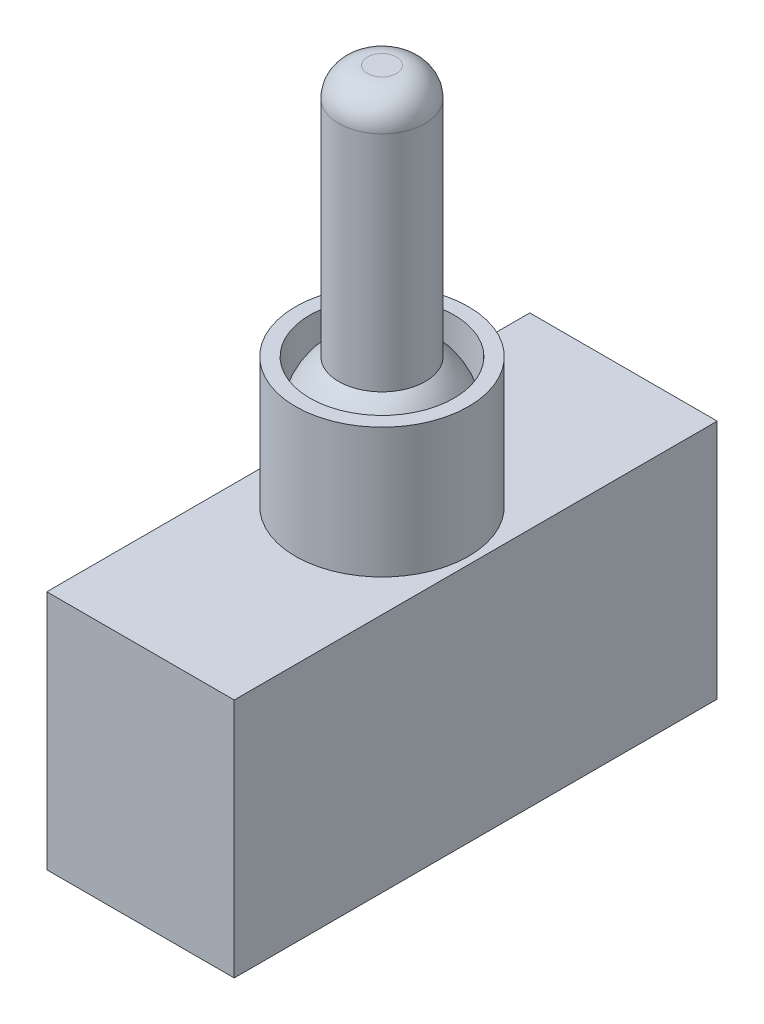
ISO-10303-21;
HEADER;
FILE_DESCRIPTION(('STEP AP214'),'2;1');
FILE_NAME('part.step','',(''),(''),'','','');
FILE_SCHEMA(('AUTOMOTIVE_DESIGN { 1 0 10303 214 1 1 1 1 }'));
ENDSEC;
DATA;
#1=APPLICATION_CONTEXT('core data for automotive mechanical design processes');
#2=APPLICATION_PROTOCOL_DEFINITION('international standard','automotive_design',2000,#1);
#3=PRODUCT_CONTEXT('',#1,'mechanical');
#4=PRODUCT('Part','Part','',(#3));
#5=PRODUCT_RELATED_PRODUCT_CATEGORY('part','',(#4));
#6=PRODUCT_DEFINITION_FORMATION('','',#4);
#7=PRODUCT_DEFINITION_CONTEXT('part definition',#1,'design');
#8=PRODUCT_DEFINITION('design','',#6,#7);
#9=PRODUCT_DEFINITION_SHAPE('','',#8);
#10=(LENGTH_UNIT() NAMED_UNIT(*) SI_UNIT(.MILLI.,.METRE.));
#11=(NAMED_UNIT(*) PLANE_ANGLE_UNIT() SI_UNIT($,.RADIAN.));
#12=(NAMED_UNIT(*) SI_UNIT($,.STERADIAN.) SOLID_ANGLE_UNIT());
#13=UNCERTAINTY_MEASURE_WITH_UNIT(LENGTH_MEASURE(1.E-05),#10,'distance_accuracy_value','');
#14=(GEOMETRIC_REPRESENTATION_CONTEXT(3) GLOBAL_UNCERTAINTY_ASSIGNED_CONTEXT((#13)) GLOBAL_UNIT_ASSIGNED_CONTEXT((#10,
#11,#12)) REPRESENTATION_CONTEXT('',''));
#15=CARTESIAN_POINT('',(0.,0.,0.));
#16=DIRECTION('',(0.,0.,1.));
#17=DIRECTION('',(1.,0.,0.));
#18=AXIS2_PLACEMENT_3D('',#15,#16,#17);
#19=CARTESIAN_POINT('',(-6.5,16.7,16.75));
#20=DIRECTION('',(1.,0.,0.));
#21=DIRECTION('',(0.,0.,-1.));
#22=AXIS2_PLACEMENT_3D('',#19,#20,#21);
#23=PLANE('',#22);
#24=DIRECTION('',(0.,0.,1.));
#25=VECTOR('',#24,1.);
#26=CARTESIAN_POINT('',(-6.5,0.,16.75));
#27=LINE('',#26,#25);
#28=CARTESIAN_POINT('',(-6.5,0.,-16.75));
#29=VERTEX_POINT('',#28);
#30=CARTESIAN_POINT('',(-6.5,0.,16.75));
#31=VERTEX_POINT('',#30);
#32=EDGE_CURVE('E103',#29,#31,#27,.T.);
#33=ORIENTED_EDGE('',*,*,#32,.T.);
#34=DIRECTION('',(0.,-1.,0.));
#35=VECTOR('',#34,1.);
#36=CARTESIAN_POINT('',(-6.5,16.7,16.75));
#37=LINE('',#36,#35);
#38=CARTESIAN_POINT('',(-6.5,16.7,16.75));
#39=VERTEX_POINT('',#38);
#40=EDGE_CURVE('E94',#39,#31,#37,.T.);
#41=ORIENTED_EDGE('',*,*,#40,.F.);
#42=DIRECTION('',(0.,0.,1.));
#43=VECTOR('',#42,1.);
#44=CARTESIAN_POINT('',(-6.5,16.7,16.75));
#45=LINE('',#44,#43);
#46=CARTESIAN_POINT('',(-6.5,16.7,-16.75));
#47=VERTEX_POINT('',#46);
#48=EDGE_CURVE('E88',#47,#39,#45,.T.);
#49=ORIENTED_EDGE('',*,*,#48,.F.);
#50=DIRECTION('',(0.,-1.,0.));
#51=VECTOR('',#50,1.);
#52=CARTESIAN_POINT('',(-6.5,16.7,-16.75));
#53=LINE('',#52,#51);
#54=EDGE_CURVE('E99',#47,#29,#53,.T.);
#55=ORIENTED_EDGE('',*,*,#54,.T.);
#56=EDGE_LOOP('',(#33,#41,#49,#55));
#57=FACE_BOUND('',#56,.T.);
#58=ADVANCED_FACE('F35',(#57),#23,.F.);
#59=CARTESIAN_POINT('',(6.5,16.7,16.75));
#60=DIRECTION('',(0.,0.,-1.));
#61=DIRECTION('',(-1.,0.,0.));
#62=AXIS2_PLACEMENT_3D('',#59,#60,#61);
#63=PLANE('',#62);
#64=DIRECTION('',(1.,0.,0.));
#65=VECTOR('',#64,1.);
#66=CARTESIAN_POINT('',(6.5,0.,16.75));
#67=LINE('',#66,#65);
#68=CARTESIAN_POINT('',(6.5,0.,16.75));
#69=VERTEX_POINT('',#68);
#70=EDGE_CURVE('E93',#31,#69,#67,.T.);
#71=ORIENTED_EDGE('',*,*,#70,.T.);
#72=DIRECTION('',(0.,-1.,0.));
#73=VECTOR('',#72,1.);
#74=CARTESIAN_POINT('',(6.5,16.7,16.75));
#75=LINE('',#74,#73);
#76=CARTESIAN_POINT('',(6.5,16.7,16.75));
#77=VERTEX_POINT('',#76);
#78=EDGE_CURVE('E91',#77,#69,#75,.T.);
#79=ORIENTED_EDGE('',*,*,#78,.F.);
#80=DIRECTION('',(1.,0.,0.));
#81=VECTOR('',#80,1.);
#82=CARTESIAN_POINT('',(6.5,16.7,16.75));
#83=LINE('',#82,#81);
#84=EDGE_CURVE('E83',#39,#77,#83,.T.);
#85=ORIENTED_EDGE('',*,*,#84,.F.);
#86=ORIENTED_EDGE('',*,*,#40,.T.);
#87=EDGE_LOOP('',(#71,#79,#85,#86));
#88=FACE_BOUND('',#87,.T.);
#89=ADVANCED_FACE('F92',(#88),#63,.F.);
#90=CARTESIAN_POINT('',(6.5,16.7,16.75));
#91=DIRECTION('',(-1.,0.,0.));
#92=DIRECTION('',(0.,0.,1.));
#93=AXIS2_PLACEMENT_3D('',#90,#91,#92);
#94=PLANE('',#93);
#95=DIRECTION('',(0.,0.,-1.));
#96=VECTOR('',#95,1.);
#97=CARTESIAN_POINT('',(6.5,0.,16.75));
#98=LINE('',#97,#96);
#99=CARTESIAN_POINT('',(6.5,0.,-16.75));
#100=VERTEX_POINT('',#99);
#101=EDGE_CURVE('E69',#69,#100,#98,.T.);
#102=ORIENTED_EDGE('',*,*,#101,.T.);
#103=DIRECTION('',(0.,-1.,0.));
#104=VECTOR('',#103,1.);
#105=CARTESIAN_POINT('',(6.5,16.7,-16.75));
#106=LINE('',#105,#104);
#107=CARTESIAN_POINT('',(6.5,16.7,-16.75));
#108=VERTEX_POINT('',#107);
#109=EDGE_CURVE('E95',#108,#100,#106,.T.);
#110=ORIENTED_EDGE('',*,*,#109,.F.);
#111=DIRECTION('',(0.,0.,-1.));
#112=VECTOR('',#111,1.);
#113=CARTESIAN_POINT('',(6.5,16.7,16.75));
#114=LINE('',#113,#112);
#115=EDGE_CURVE('E86',#77,#108,#114,.T.);
#116=ORIENTED_EDGE('',*,*,#115,.F.);
#117=ORIENTED_EDGE('',*,*,#78,.T.);
#118=EDGE_LOOP('',(#102,#110,#116,#117));
#119=FACE_BOUND('',#118,.T.);
#120=ADVANCED_FACE('F97',(#119),#94,.F.);
#121=CARTESIAN_POINT('',(6.5,16.7,-16.75));
#122=DIRECTION('',(0.,0.,1.));
#123=DIRECTION('',(1.,0.,0.));
#124=AXIS2_PLACEMENT_3D('',#121,#122,#123);
#125=PLANE('',#124);
#126=DIRECTION('',(-1.,0.,0.));
#127=VECTOR('',#126,1.);
#128=CARTESIAN_POINT('',(6.5,0.,-16.75));
#129=LINE('',#128,#127);
#130=EDGE_CURVE('E75',#100,#29,#129,.T.);
#131=ORIENTED_EDGE('',*,*,#130,.T.);
#132=ORIENTED_EDGE('',*,*,#54,.F.);
#133=DIRECTION('',(-1.,0.,0.));
#134=VECTOR('',#133,1.);
#135=CARTESIAN_POINT('',(6.5,16.7,-16.75));
#136=LINE('',#135,#134);
#137=EDGE_CURVE('E52',#108,#47,#136,.T.);
#138=ORIENTED_EDGE('',*,*,#137,.F.);
#139=ORIENTED_EDGE('',*,*,#109,.T.);
#140=EDGE_LOOP('',(#131,#132,#138,#139));
#141=FACE_BOUND('',#140,.T.);
#142=ADVANCED_FACE('F138',(#141),#125,.F.);
#143=CARTESIAN_POINT('',(0.,16.7,0.));
#144=DIRECTION('',(0.,1.,0.));
#145=DIRECTION('',(0.,0.,1.));
#146=AXIS2_PLACEMENT_3D('',#143,#144,#145);
#147=PLANE('',#146);
#148=CARTESIAN_POINT('',(0.,16.7,0.));
#149=DIRECTION('',(0.,1.,0.));
#150=DIRECTION('',(0.,0.,1.));
#151=AXIS2_PLACEMENT_3D('',#148,#149,#150);
#152=CIRCLE('',#151,6.);
#153=CARTESIAN_POINT('',(0.,16.7,6.));
#154=VERTEX_POINT('',#153);
#155=EDGE_CURVE('E173',#154,#154,#152,.T.);
#156=ORIENTED_EDGE('',*,*,#155,.F.);
#157=EDGE_LOOP('',(#156));
#158=FACE_BOUND('',#157,.T.);
#159=ORIENTED_EDGE('',*,*,#48,.T.);
#160=ORIENTED_EDGE('',*,*,#84,.T.);
#161=ORIENTED_EDGE('',*,*,#115,.T.);
#162=ORIENTED_EDGE('',*,*,#137,.T.);
#163=EDGE_LOOP('',(#159,#160,#161,#162));
#164=FACE_BOUND('',#163,.T.);
#165=ADVANCED_FACE('F84',(#158,#164),#147,.T.);
#166=CARTESIAN_POINT('',(0.,0.,0.));
#167=DIRECTION('',(0.,1.,0.));
#168=DIRECTION('',(0.,0.,1.));
#169=AXIS2_PLACEMENT_3D('',#166,#167,#168);
#170=PLANE('',#169);
#171=ORIENTED_EDGE('',*,*,#32,.F.);
#172=ORIENTED_EDGE('',*,*,#130,.F.);
#173=ORIENTED_EDGE('',*,*,#101,.F.);
#174=ORIENTED_EDGE('',*,*,#70,.F.);
#175=EDGE_LOOP('',(#171,#172,#173,#174));
#176=FACE_BOUND('',#175,.T.);
#177=ADVANCED_FACE('F141',(#176),#170,.F.);
#178=CARTESIAN_POINT('',(0.,25.7,0.));
#179=DIRECTION('',(0.,-1.,0.));
#180=DIRECTION('',(0.,0.,-1.));
#181=AXIS2_PLACEMENT_3D('',#178,#179,#180);
#182=CYLINDRICAL_SURFACE('',#181,6.);
#183=CARTESIAN_POINT('',(0.,25.7,0.));
#184=DIRECTION('',(0.,1.,0.));
#185=DIRECTION('',(0.,0.,1.));
#186=AXIS2_PLACEMENT_3D('',#183,#184,#185);
#187=CIRCLE('',#186,6.);
#188=CARTESIAN_POINT('',(0.,25.7,6.));
#189=VERTEX_POINT('',#188);
#190=EDGE_CURVE('E106',#189,#189,#187,.T.);
#191=ORIENTED_EDGE('',*,*,#190,.F.);
#192=EDGE_LOOP('',(#191));
#193=FACE_BOUND('',#192,.T.);
#194=ORIENTED_EDGE('',*,*,#155,.T.);
#195=EDGE_LOOP('',(#194));
#196=FACE_BOUND('',#195,.T.);
#197=ADVANCED_FACE('F144',(#193,#196),#182,.T.);
#198=CARTESIAN_POINT('',(0.,25.7,0.));
#199=DIRECTION('',(0.,1.,0.));
#200=DIRECTION('',(0.,0.,1.));
#201=AXIS2_PLACEMENT_3D('',#198,#199,#200);
#202=PLANE('',#201);
#203=CARTESIAN_POINT('',(0.,25.7,0.));
#204=DIRECTION('',(0.,1.,0.));
#205=DIRECTION('',(0.,0.,1.));
#206=AXIS2_PLACEMENT_3D('',#203,#204,#205);
#207=CIRCLE('',#206,5.);
#208=CARTESIAN_POINT('',(0.,25.7,5.));
#209=VERTEX_POINT('',#208);
#210=EDGE_CURVE('E174',#209,#209,#207,.T.);
#211=ORIENTED_EDGE('',*,*,#210,.F.);
#212=EDGE_LOOP('',(#211));
#213=FACE_BOUND('',#212,.T.);
#214=ORIENTED_EDGE('',*,*,#190,.T.);
#215=EDGE_LOOP('',(#214));
#216=FACE_BOUND('',#215,.T.);
#217=ADVANCED_FACE('F151',(#213,#216),#202,.T.);
#218=CARTESIAN_POINT('',(0.,21.7,0.));
#219=DIRECTION('',(0.,1.,0.));
#220=DIRECTION('',(0.,0.,1.));
#221=AXIS2_PLACEMENT_3D('',#218,#219,#220);
#222=CYLINDRICAL_SURFACE('',#221,5.);
#223=CARTESIAN_POINT('',(0.,21.7,0.));
#224=DIRECTION('',(0.,1.,0.));
#225=DIRECTION('',(0.,0.,1.));
#226=AXIS2_PLACEMENT_3D('',#223,#224,#225);
#227=CIRCLE('',#226,5.);
#228=CARTESIAN_POINT('',(0.,21.7,5.));
#229=VERTEX_POINT('',#228);
#230=EDGE_CURVE('E170',#229,#229,#227,.T.);
#231=ORIENTED_EDGE('',*,*,#230,.F.);
#232=EDGE_LOOP('',(#231));
#233=FACE_BOUND('',#232,.T.);
#234=ORIENTED_EDGE('',*,*,#210,.T.);
#235=EDGE_LOOP('',(#234));
#236=FACE_BOUND('',#235,.T.);
#237=ADVANCED_FACE('F155',(#233,#236),#222,.F.);
#238=CARTESIAN_POINT('',(0.,21.7,0.));
#239=DIRECTION('',(0.,0.,1.));
#240=DIRECTION('',(1.,0.,0.));
#241=AXIS2_PLACEMENT_3D('',#238,#239,#240);
#242=SPHERICAL_SURFACE('',#241,5.);
#243=CARTESIAN_POINT('',(0.,21.7,0.));
#244=DIRECTION('',(0.,1.,0.));
#245=DIRECTION('',(0.,0.,1.));
#246=AXIS2_PLACEMENT_3D('',#243,#244,#245);
#247=SPHERICAL_SURFACE('',#246,5.);
#248=ORIENTED_EDGE('',*,*,#230,.T.);
#249=EDGE_LOOP('',(#248));
#250=FACE_BOUND('',#249,.T.);
#251=CARTESIAN_POINT('',(0.,25.7,0.));
#252=DIRECTION('',(0.,-1.,0.));
#253=DIRECTION('',(0.,0.,-1.));
#254=AXIS2_PLACEMENT_3D('',#251,#252,#253);
#255=CIRCLE('',#254,3.);
#256=CARTESIAN_POINT('',(0.,25.7,-3.));
#257=VERTEX_POINT('',#256);
#258=EDGE_CURVE('E113',#257,#257,#255,.T.);
#259=ORIENTED_EDGE('',*,*,#258,.T.);
#260=EDGE_LOOP('',(#259));
#261=FACE_BOUND('',#260,.T.);
#262=ADVANCED_FACE('F158',(#250,#261),#247,.T.);
#263=CARTESIAN_POINT('',(0.,43.2,0.));
#264=DIRECTION('',(0.,1.,0.));
#265=DIRECTION('',(0.,0.,1.));
#266=AXIS2_PLACEMENT_3D('',#263,#264,#265);
#267=PLANE('',#266);
#268=CARTESIAN_POINT('',(0.,43.2,0.));
#269=DIRECTION('',(0.,1.,0.));
#270=DIRECTION('',(0.,0.,1.));
#271=AXIS2_PLACEMENT_3D('',#268,#269,#270);
#272=CIRCLE('',#271,1.);
#273=CARTESIAN_POINT('',(0.,43.2,1.));
#274=VERTEX_POINT('',#273);
#275=EDGE_CURVE('E44',#274,#274,#272,.T.);
#276=ORIENTED_EDGE('',*,*,#275,.T.);
#277=EDGE_LOOP('',(#276));
#278=FACE_BOUND('',#277,.T.);
#279=ADVANCED_FACE('F118',(#278),#267,.T.);
#280=CARTESIAN_POINT('',(0.,43.2,0.));
#281=DIRECTION('',(0.,-1.,0.));
#282=DIRECTION('',(0.,0.,-1.));
#283=AXIS2_PLACEMENT_3D('',#280,#281,#282);
#284=CYLINDRICAL_SURFACE('',#283,3.);
#285=CARTESIAN_POINT('',(0.,41.2,0.));
#286=DIRECTION('',(0.,1.,0.));
#287=DIRECTION('',(0.,0.,1.));
#288=AXIS2_PLACEMENT_3D('',#285,#286,#287);
#289=CIRCLE('',#288,3.);
#290=CARTESIAN_POINT('',(0.,41.2,3.));
#291=VERTEX_POINT('',#290);
#292=EDGE_CURVE('E11',#291,#291,#289,.F.);
#293=ORIENTED_EDGE('',*,*,#292,.T.);
#294=EDGE_LOOP('',(#293));
#295=FACE_BOUND('',#294,.T.);
#296=ORIENTED_EDGE('',*,*,#258,.F.);
#297=EDGE_LOOP('',(#296));
#298=FACE_BOUND('',#297,.T.);
#299=ADVANCED_FACE('F121',(#295,#298),#284,.T.);
#300=CARTESIAN_POINT('',(0.,41.2,0.));
#301=DIRECTION('',(0.,1.,0.));
#302=DIRECTION('',(0.,0.,1.));
#303=AXIS2_PLACEMENT_3D('',#300,#301,#302);
#304=DEGENERATE_TOROIDAL_SURFACE('',#303,1.,2.,.T.);
#305=ORIENTED_EDGE('',*,*,#292,.F.);
#306=EDGE_LOOP('',(#305));
#307=FACE_BOUND('',#306,.T.);
#308=ORIENTED_EDGE('',*,*,#275,.F.);
#309=EDGE_LOOP('',(#308));
#310=FACE_BOUND('',#309,.T.);
#311=ADVANCED_FACE('F37',(#307,#310),#304,.T.);
#312=CLOSED_SHELL('',(#58,#89,#120,#142,#165,#177,#197,#217,#237,#262,#279,#299,#311));
#313=MANIFOLD_SOLID_BREP('B2',#312);
#314=ADVANCED_BREP_SHAPE_REPRESENTATION('',(#18,#313),#14);
#315=SHAPE_DEFINITION_REPRESENTATION(#9,#314);
ENDSEC;
END-ISO-10303-21;
